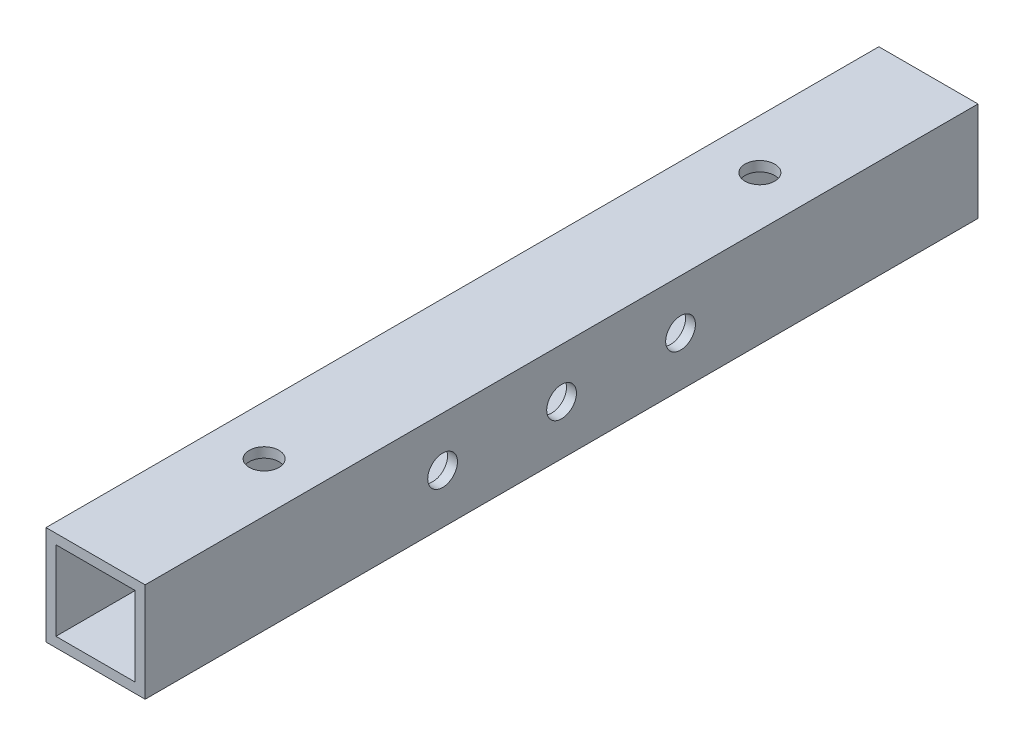
ISO-10303-21;
HEADER;
FILE_DESCRIPTION(('STEP AP214'),'2;1');
FILE_NAME('part.step','',(''),(''),'','','');
FILE_SCHEMA(('AUTOMOTIVE_DESIGN { 1 0 10303 214 1 1 1 1 }'));
ENDSEC;
DATA;
#1=APPLICATION_CONTEXT('core data for automotive mechanical design processes');
#2=APPLICATION_PROTOCOL_DEFINITION('international standard','automotive_design',2000,#1);
#3=PRODUCT_CONTEXT('',#1,'mechanical');
#4=PRODUCT('Part','Part','',(#3));
#5=PRODUCT_RELATED_PRODUCT_CATEGORY('part','',(#4));
#6=PRODUCT_DEFINITION_FORMATION('','',#4);
#7=PRODUCT_DEFINITION_CONTEXT('part definition',#1,'design');
#8=PRODUCT_DEFINITION('design','',#6,#7);
#9=PRODUCT_DEFINITION_SHAPE('','',#8);
#10=(LENGTH_UNIT() NAMED_UNIT(*) SI_UNIT(.MILLI.,.METRE.));
#11=(NAMED_UNIT(*) PLANE_ANGLE_UNIT() SI_UNIT($,.RADIAN.));
#12=(NAMED_UNIT(*) SI_UNIT($,.STERADIAN.) SOLID_ANGLE_UNIT());
#13=UNCERTAINTY_MEASURE_WITH_UNIT(LENGTH_MEASURE(1.E-05),#10,'distance_accuracy_value','');
#14=(GEOMETRIC_REPRESENTATION_CONTEXT(3) GLOBAL_UNCERTAINTY_ASSIGNED_CONTEXT((#13)) GLOBAL_UNIT_ASSIGNED_CONTEXT((#10,
#11,#12)) REPRESENTATION_CONTEXT('',''));
#15=CARTESIAN_POINT('',(0.,0.,0.));
#16=DIRECTION('',(0.,0.,1.));
#17=DIRECTION('',(1.,0.,0.));
#18=AXIS2_PLACEMENT_3D('',#15,#16,#17);
#19=CARTESIAN_POINT('',(0.,0.,84.));
#20=DIRECTION('',(0.,0.,1.));
#21=DIRECTION('',(1.,0.,0.));
#22=AXIS2_PLACEMENT_3D('',#19,#20,#21);
#23=PLANE('',#22);
#24=DIRECTION('',(0.,-1.,0.));
#25=VECTOR('',#24,1.);
#26=CARTESIAN_POINT('',(-5.,5.,84.));
#27=LINE('',#26,#25);
#28=CARTESIAN_POINT('',(-5.,5.,84.));
#29=VERTEX_POINT('',#28);
#30=CARTESIAN_POINT('',(-5.,-5.,84.));
#31=VERTEX_POINT('',#30);
#32=EDGE_CURVE('E168',#29,#31,#27,.T.);
#33=ORIENTED_EDGE('',*,*,#32,.T.);
#34=DIRECTION('',(1.,0.,0.));
#35=VECTOR('',#34,1.);
#36=CARTESIAN_POINT('',(-5.,-5.,84.));
#37=LINE('',#36,#35);
#38=CARTESIAN_POINT('',(5.,-5.,84.));
#39=VERTEX_POINT('',#38);
#40=EDGE_CURVE('E171',#31,#39,#37,.T.);
#41=ORIENTED_EDGE('',*,*,#40,.T.);
#42=DIRECTION('',(0.,1.,0.));
#43=VECTOR('',#42,1.);
#44=CARTESIAN_POINT('',(5.,5.,84.));
#45=LINE('',#44,#43);
#46=CARTESIAN_POINT('',(5.,5.,84.));
#47=VERTEX_POINT('',#46);
#48=EDGE_CURVE('E174',#39,#47,#45,.T.);
#49=ORIENTED_EDGE('',*,*,#48,.T.);
#50=DIRECTION('',(-1.,0.,0.));
#51=VECTOR('',#50,1.);
#52=CARTESIAN_POINT('',(-5.,5.,84.));
#53=LINE('',#52,#51);
#54=EDGE_CURVE('E176',#47,#29,#53,.T.);
#55=ORIENTED_EDGE('',*,*,#54,.T.);
#56=EDGE_LOOP('',(#33,#41,#49,#55));
#57=FACE_BOUND('',#56,.T.);
#58=DIRECTION('',(1.,0.,0.));
#59=VECTOR('',#58,1.);
#60=CARTESIAN_POINT('',(-5.,-4.,84.));
#61=LINE('',#60,#59);
#62=CARTESIAN_POINT('',(-4.,-4.,84.));
#63=VERTEX_POINT('',#62);
#64=CARTESIAN_POINT('',(4.,-4.,84.));
#65=VERTEX_POINT('',#64);
#66=EDGE_CURVE('E138',#63,#65,#61,.T.);
#67=ORIENTED_EDGE('',*,*,#66,.F.);
#68=DIRECTION('',(0.,-1.,0.));
#69=VECTOR('',#68,1.);
#70=CARTESIAN_POINT('',(-4.,5.,84.));
#71=LINE('',#70,#69);
#72=CARTESIAN_POINT('',(-4.,4.,84.));
#73=VERTEX_POINT('',#72);
#74=EDGE_CURVE('E130',#73,#63,#71,.T.);
#75=ORIENTED_EDGE('',*,*,#74,.F.);
#76=DIRECTION('',(-1.,0.,0.));
#77=VECTOR('',#76,1.);
#78=CARTESIAN_POINT('',(-5.,4.,84.));
#79=LINE('',#78,#77);
#80=CARTESIAN_POINT('',(4.,4.,84.));
#81=VERTEX_POINT('',#80);
#82=EDGE_CURVE('E152',#81,#73,#79,.T.);
#83=ORIENTED_EDGE('',*,*,#82,.F.);
#84=DIRECTION('',(0.,1.,0.));
#85=VECTOR('',#84,1.);
#86=CARTESIAN_POINT('',(4.,5.,84.));
#87=LINE('',#86,#85);
#88=EDGE_CURVE('E150',#65,#81,#87,.T.);
#89=ORIENTED_EDGE('',*,*,#88,.F.);
#90=EDGE_LOOP('',(#67,#75,#83,#89));
#91=FACE_BOUND('',#90,.T.);
#92=ADVANCED_FACE('F63',(#57,#91),#23,.T.);
#93=CARTESIAN_POINT('',(0.,0.,0.));
#94=DIRECTION('',(0.,0.,1.));
#95=DIRECTION('',(1.,0.,0.));
#96=AXIS2_PLACEMENT_3D('',#93,#94,#95);
#97=PLANE('',#96);
#98=DIRECTION('',(0.,-1.,0.));
#99=VECTOR('',#98,1.);
#100=CARTESIAN_POINT('',(-5.,5.,0.));
#101=LINE('',#100,#99);
#102=CARTESIAN_POINT('',(-5.,5.,0.));
#103=VERTEX_POINT('',#102);
#104=CARTESIAN_POINT('',(-5.,-5.,0.));
#105=VERTEX_POINT('',#104);
#106=EDGE_CURVE('E146',#103,#105,#101,.T.);
#107=ORIENTED_EDGE('',*,*,#106,.F.);
#108=DIRECTION('',(-1.,0.,0.));
#109=VECTOR('',#108,1.);
#110=CARTESIAN_POINT('',(-5.,5.,0.));
#111=LINE('',#110,#109);
#112=CARTESIAN_POINT('',(5.,5.,0.));
#113=VERTEX_POINT('',#112);
#114=EDGE_CURVE('E172',#113,#103,#111,.T.);
#115=ORIENTED_EDGE('',*,*,#114,.F.);
#116=DIRECTION('',(0.,1.,0.));
#117=VECTOR('',#116,1.);
#118=CARTESIAN_POINT('',(5.,5.,0.));
#119=LINE('',#118,#117);
#120=CARTESIAN_POINT('',(5.,-5.,0.));
#121=VERTEX_POINT('',#120);
#122=EDGE_CURVE('E183',#121,#113,#119,.T.);
#123=ORIENTED_EDGE('',*,*,#122,.F.);
#124=DIRECTION('',(1.,0.,0.));
#125=VECTOR('',#124,1.);
#126=CARTESIAN_POINT('',(-5.,-5.,0.));
#127=LINE('',#126,#125);
#128=EDGE_CURVE('E181',#105,#121,#127,.T.);
#129=ORIENTED_EDGE('',*,*,#128,.F.);
#130=EDGE_LOOP('',(#107,#115,#123,#129));
#131=FACE_BOUND('',#130,.T.);
#132=DIRECTION('',(0.,-1.,0.));
#133=VECTOR('',#132,1.);
#134=CARTESIAN_POINT('',(-4.,5.,0.));
#135=LINE('',#134,#133);
#136=CARTESIAN_POINT('',(-4.,4.,0.));
#137=VERTEX_POINT('',#136);
#138=CARTESIAN_POINT('',(-4.,-4.,0.));
#139=VERTEX_POINT('',#138);
#140=EDGE_CURVE('E88',#137,#139,#135,.T.);
#141=ORIENTED_EDGE('',*,*,#140,.T.);
#142=DIRECTION('',(1.,0.,0.));
#143=VECTOR('',#142,1.);
#144=CARTESIAN_POINT('',(-5.,-4.,0.));
#145=LINE('',#144,#143);
#146=CARTESIAN_POINT('',(4.,-4.,0.));
#147=VERTEX_POINT('',#146);
#148=EDGE_CURVE('E145',#139,#147,#145,.T.);
#149=ORIENTED_EDGE('',*,*,#148,.T.);
#150=DIRECTION('',(0.,1.,0.));
#151=VECTOR('',#150,1.);
#152=CARTESIAN_POINT('',(4.,5.,0.));
#153=LINE('',#152,#151);
#154=CARTESIAN_POINT('',(4.,4.,0.));
#155=VERTEX_POINT('',#154);
#156=EDGE_CURVE('E160',#147,#155,#153,.T.);
#157=ORIENTED_EDGE('',*,*,#156,.T.);
#158=DIRECTION('',(-1.,0.,0.));
#159=VECTOR('',#158,1.);
#160=CARTESIAN_POINT('',(-5.,4.,0.));
#161=LINE('',#160,#159);
#162=EDGE_CURVE('E139',#155,#137,#161,.T.);
#163=ORIENTED_EDGE('',*,*,#162,.T.);
#164=EDGE_LOOP('',(#141,#149,#157,#163));
#165=FACE_BOUND('',#164,.T.);
#166=ADVANCED_FACE('F275',(#131,#165),#97,.F.);
#167=CARTESIAN_POINT('',(-5.,5.,84.));
#168=DIRECTION('',(1.,0.,0.));
#169=DIRECTION('',(0.,0.,-1.));
#170=AXIS2_PLACEMENT_3D('',#167,#168,#169);
#171=PLANE('',#170);
#172=CARTESIAN_POINT('',(-5.,0.,54.));
#173=DIRECTION('',(1.,0.,0.));
#174=DIRECTION('',(0.,1.,0.));
#175=AXIS2_PLACEMENT_3D('',#172,#173,#174);
#176=CIRCLE('',#175,1.5);
#177=CARTESIAN_POINT('',(-5.,1.5,54.));
#178=VERTEX_POINT('',#177);
#179=EDGE_CURVE('E197',#178,#178,#176,.T.);
#180=ORIENTED_EDGE('',*,*,#179,.T.);
#181=EDGE_LOOP('',(#180));
#182=FACE_BOUND('',#181,.T.);
#183=CARTESIAN_POINT('',(-5.,0.,30.));
#184=DIRECTION('',(1.,0.,0.));
#185=DIRECTION('',(0.,1.,0.));
#186=AXIS2_PLACEMENT_3D('',#183,#184,#185);
#187=CIRCLE('',#186,1.5);
#188=CARTESIAN_POINT('',(-5.,1.50000000000001,30.));
#189=VERTEX_POINT('',#188);
#190=EDGE_CURVE('E238',#189,#189,#187,.T.);
#191=ORIENTED_EDGE('',*,*,#190,.T.);
#192=EDGE_LOOP('',(#191));
#193=FACE_BOUND('',#192,.T.);
#194=CARTESIAN_POINT('',(-5.,0.,42.));
#195=DIRECTION('',(1.,0.,0.));
#196=DIRECTION('',(0.,1.,0.));
#197=AXIS2_PLACEMENT_3D('',#194,#195,#196);
#198=CIRCLE('',#197,1.5);
#199=CARTESIAN_POINT('',(-5.,1.5,42.));
#200=VERTEX_POINT('',#199);
#201=EDGE_CURVE('E229',#200,#200,#198,.T.);
#202=ORIENTED_EDGE('',*,*,#201,.T.);
#203=EDGE_LOOP('',(#202));
#204=FACE_BOUND('',#203,.T.);
#205=ORIENTED_EDGE('',*,*,#106,.T.);
#206=DIRECTION('',(0.,0.,-1.));
#207=VECTOR('',#206,1.);
#208=CARTESIAN_POINT('',(-5.,-5.,84.));
#209=LINE('',#208,#207);
#210=EDGE_CURVE('E12',#31,#105,#209,.T.);
#211=ORIENTED_EDGE('',*,*,#210,.F.);
#212=ORIENTED_EDGE('',*,*,#32,.F.);
#213=DIRECTION('',(0.,0.,-1.));
#214=VECTOR('',#213,1.);
#215=CARTESIAN_POINT('',(-5.,5.,84.));
#216=LINE('',#215,#214);
#217=EDGE_CURVE('E178',#29,#103,#216,.T.);
#218=ORIENTED_EDGE('',*,*,#217,.T.);
#219=EDGE_LOOP('',(#205,#211,#212,#218));
#220=FACE_BOUND('',#219,.T.);
#221=ADVANCED_FACE('F65',(#182,#193,#204,#220),#171,.F.);
#222=CARTESIAN_POINT('',(-5.,-5.,84.));
#223=DIRECTION('',(0.,1.,0.));
#224=DIRECTION('',(0.,0.,1.));
#225=AXIS2_PLACEMENT_3D('',#222,#223,#224);
#226=PLANE('',#225);
#227=CARTESIAN_POINT('',(0.,-5.,17.));
#228=DIRECTION('',(0.,-1.,0.));
#229=DIRECTION('',(0.,0.,-1.));
#230=AXIS2_PLACEMENT_3D('',#227,#228,#229);
#231=CIRCLE('',#230,1.5);
#232=CARTESIAN_POINT('',(0.,-5.,15.5));
#233=VERTEX_POINT('',#232);
#234=EDGE_CURVE('E213',#233,#233,#231,.T.);
#235=ORIENTED_EDGE('',*,*,#234,.F.);
#236=EDGE_LOOP('',(#235));
#237=FACE_BOUND('',#236,.T.);
#238=CARTESIAN_POINT('',(0.,-5.,67.));
#239=DIRECTION('',(0.,-1.,0.));
#240=DIRECTION('',(0.,0.,1.));
#241=AXIS2_PLACEMENT_3D('',#238,#239,#240);
#242=CIRCLE('',#241,1.5);
#243=CARTESIAN_POINT('',(0.,-5.,68.5));
#244=VERTEX_POINT('',#243);
#245=EDGE_CURVE('E218',#244,#244,#242,.T.);
#246=ORIENTED_EDGE('',*,*,#245,.F.);
#247=EDGE_LOOP('',(#246));
#248=FACE_BOUND('',#247,.T.);
#249=ORIENTED_EDGE('',*,*,#128,.T.);
#250=DIRECTION('',(0.,0.,-1.));
#251=VECTOR('',#250,1.);
#252=CARTESIAN_POINT('',(5.,-5.,84.));
#253=LINE('',#252,#251);
#254=EDGE_CURVE('E72',#39,#121,#253,.T.);
#255=ORIENTED_EDGE('',*,*,#254,.F.);
#256=ORIENTED_EDGE('',*,*,#40,.F.);
#257=ORIENTED_EDGE('',*,*,#210,.T.);
#258=EDGE_LOOP('',(#249,#255,#256,#257));
#259=FACE_BOUND('',#258,.T.);
#260=ADVANCED_FACE('F274',(#237,#248,#259),#226,.F.);
#261=CARTESIAN_POINT('',(5.,5.,84.));
#262=DIRECTION('',(-1.,0.,0.));
#263=DIRECTION('',(0.,-1.,0.));
#264=AXIS2_PLACEMENT_3D('',#261,#262,#263);
#265=PLANE('',#264);
#266=CARTESIAN_POINT('',(5.,0.,54.));
#267=DIRECTION('',(1.,0.,0.));
#268=DIRECTION('',(0.,1.,0.));
#269=AXIS2_PLACEMENT_3D('',#266,#267,#268);
#270=CIRCLE('',#269,1.5);
#271=CARTESIAN_POINT('',(5.,1.5,54.));
#272=VERTEX_POINT('',#271);
#273=EDGE_CURVE('E232',#272,#272,#270,.T.);
#274=ORIENTED_EDGE('',*,*,#273,.F.);
#275=EDGE_LOOP('',(#274));
#276=FACE_BOUND('',#275,.T.);
#277=CARTESIAN_POINT('',(5.,0.,30.));
#278=DIRECTION('',(1.,0.,0.));
#279=DIRECTION('',(0.,1.,0.));
#280=AXIS2_PLACEMENT_3D('',#277,#278,#279);
#281=CIRCLE('',#280,1.5);
#282=CARTESIAN_POINT('',(5.,1.50000000000001,30.));
#283=VERTEX_POINT('',#282);
#284=EDGE_CURVE('E235',#283,#283,#281,.T.);
#285=ORIENTED_EDGE('',*,*,#284,.F.);
#286=EDGE_LOOP('',(#285));
#287=FACE_BOUND('',#286,.T.);
#288=CARTESIAN_POINT('',(5.,0.,42.));
#289=DIRECTION('',(1.,0.,0.));
#290=DIRECTION('',(0.,1.,0.));
#291=AXIS2_PLACEMENT_3D('',#288,#289,#290);
#292=CIRCLE('',#291,1.5);
#293=CARTESIAN_POINT('',(5.,1.5,42.));
#294=VERTEX_POINT('',#293);
#295=EDGE_CURVE('E241',#294,#294,#292,.T.);
#296=ORIENTED_EDGE('',*,*,#295,.F.);
#297=EDGE_LOOP('',(#296));
#298=FACE_BOUND('',#297,.T.);
#299=ORIENTED_EDGE('',*,*,#122,.T.);
#300=DIRECTION('',(0.,0.,-1.));
#301=VECTOR('',#300,1.);
#302=CARTESIAN_POINT('',(5.,5.,84.));
#303=LINE('',#302,#301);
#304=EDGE_CURVE('E188',#47,#113,#303,.T.);
#305=ORIENTED_EDGE('',*,*,#304,.F.);
#306=ORIENTED_EDGE('',*,*,#48,.F.);
#307=ORIENTED_EDGE('',*,*,#254,.T.);
#308=EDGE_LOOP('',(#299,#305,#306,#307));
#309=FACE_BOUND('',#308,.T.);
#310=ADVANCED_FACE('F293',(#276,#287,#298,#309),#265,.F.);
#311=CARTESIAN_POINT('',(-5.,5.,84.));
#312=DIRECTION('',(0.,-1.,0.));
#313=DIRECTION('',(0.,0.,-1.));
#314=AXIS2_PLACEMENT_3D('',#311,#312,#313);
#315=PLANE('',#314);
#316=CARTESIAN_POINT('',(0.,5.,17.));
#317=DIRECTION('',(0.,-1.,0.));
#318=DIRECTION('',(0.,0.,-1.));
#319=AXIS2_PLACEMENT_3D('',#316,#317,#318);
#320=CIRCLE('',#319,1.5);
#321=CARTESIAN_POINT('',(0.,5.,15.5));
#322=VERTEX_POINT('',#321);
#323=EDGE_CURVE('E207',#322,#322,#320,.T.);
#324=ORIENTED_EDGE('',*,*,#323,.T.);
#325=EDGE_LOOP('',(#324));
#326=FACE_BOUND('',#325,.T.);
#327=CARTESIAN_POINT('',(0.,5.,67.));
#328=DIRECTION('',(0.,-1.,0.));
#329=DIRECTION('',(0.,0.,1.));
#330=AXIS2_PLACEMENT_3D('',#327,#328,#329);
#331=CIRCLE('',#330,1.5);
#332=CARTESIAN_POINT('',(0.,5.,68.5));
#333=VERTEX_POINT('',#332);
#334=EDGE_CURVE('E223',#333,#333,#331,.T.);
#335=ORIENTED_EDGE('',*,*,#334,.T.);
#336=EDGE_LOOP('',(#335));
#337=FACE_BOUND('',#336,.T.);
#338=ORIENTED_EDGE('',*,*,#114,.T.);
#339=ORIENTED_EDGE('',*,*,#217,.F.);
#340=ORIENTED_EDGE('',*,*,#54,.F.);
#341=ORIENTED_EDGE('',*,*,#304,.T.);
#342=EDGE_LOOP('',(#338,#339,#340,#341));
#343=FACE_BOUND('',#342,.T.);
#344=ADVANCED_FACE('F257',(#326,#337,#343),#315,.F.);
#345=CARTESIAN_POINT('',(-4.,5.,84.));
#346=DIRECTION('',(1.,0.,0.));
#347=DIRECTION('',(0.,0.,-1.));
#348=AXIS2_PLACEMENT_3D('',#345,#346,#347);
#349=PLANE('',#348);
#350=CARTESIAN_POINT('',(-4.,0.,54.));
#351=DIRECTION('',(1.,0.,0.));
#352=DIRECTION('',(0.,0.,-1.));
#353=AXIS2_PLACEMENT_3D('',#350,#351,#352);
#354=CIRCLE('',#353,1.5);
#355=CARTESIAN_POINT('',(-4.,0.,52.5));
#356=VERTEX_POINT('',#355);
#357=EDGE_CURVE('E158',#356,#356,#354,.T.);
#358=ORIENTED_EDGE('',*,*,#357,.F.);
#359=EDGE_LOOP('',(#358));
#360=FACE_BOUND('',#359,.T.);
#361=CARTESIAN_POINT('',(-4.,0.,30.));
#362=DIRECTION('',(1.,0.,0.));
#363=DIRECTION('',(0.,0.,-1.));
#364=AXIS2_PLACEMENT_3D('',#361,#362,#363);
#365=CIRCLE('',#364,1.5);
#366=CARTESIAN_POINT('',(-4.,0.,28.5));
#367=VERTEX_POINT('',#366);
#368=EDGE_CURVE('E201',#367,#367,#365,.T.);
#369=ORIENTED_EDGE('',*,*,#368,.F.);
#370=EDGE_LOOP('',(#369));
#371=FACE_BOUND('',#370,.T.);
#372=CARTESIAN_POINT('',(-4.,0.,42.));
#373=DIRECTION('',(1.,0.,0.));
#374=DIRECTION('',(0.,0.,-1.));
#375=AXIS2_PLACEMENT_3D('',#372,#373,#374);
#376=CIRCLE('',#375,1.5);
#377=CARTESIAN_POINT('',(-4.,0.,40.5));
#378=VERTEX_POINT('',#377);
#379=EDGE_CURVE('E196',#378,#378,#376,.T.);
#380=ORIENTED_EDGE('',*,*,#379,.F.);
#381=EDGE_LOOP('',(#380));
#382=FACE_BOUND('',#381,.T.);
#383=ORIENTED_EDGE('',*,*,#140,.F.);
#384=DIRECTION('',(0.,0.,-1.));
#385=VECTOR('',#384,1.);
#386=CARTESIAN_POINT('',(-4.,4.,84.));
#387=LINE('',#386,#385);
#388=EDGE_CURVE('E134',#73,#137,#387,.T.);
#389=ORIENTED_EDGE('',*,*,#388,.F.);
#390=ORIENTED_EDGE('',*,*,#74,.T.);
#391=DIRECTION('',(0.,0.,-1.));
#392=VECTOR('',#391,1.);
#393=CARTESIAN_POINT('',(-4.,-4.,84.));
#394=LINE('',#393,#392);
#395=EDGE_CURVE('E133',#63,#139,#394,.T.);
#396=ORIENTED_EDGE('',*,*,#395,.T.);
#397=EDGE_LOOP('',(#383,#389,#390,#396));
#398=FACE_BOUND('',#397,.T.);
#399=ADVANCED_FACE('F132',(#360,#371,#382,#398),#349,.T.);
#400=CARTESIAN_POINT('',(-5.,-4.,84.));
#401=DIRECTION('',(0.,1.,0.));
#402=DIRECTION('',(0.,0.,1.));
#403=AXIS2_PLACEMENT_3D('',#400,#401,#402);
#404=PLANE('',#403);
#405=CARTESIAN_POINT('',(0.,-4.,17.));
#406=DIRECTION('',(0.,1.,0.));
#407=DIRECTION('',(0.,0.,1.));
#408=AXIS2_PLACEMENT_3D('',#405,#406,#407);
#409=CIRCLE('',#408,1.5);
#410=CARTESIAN_POINT('',(0.,-4.,18.5));
#411=VERTEX_POINT('',#410);
#412=EDGE_CURVE('E226',#411,#411,#409,.T.);
#413=ORIENTED_EDGE('',*,*,#412,.F.);
#414=EDGE_LOOP('',(#413));
#415=FACE_BOUND('',#414,.T.);
#416=CARTESIAN_POINT('',(0.,-4.,67.));
#417=DIRECTION('',(0.,1.,0.));
#418=DIRECTION('',(0.,0.,1.));
#419=AXIS2_PLACEMENT_3D('',#416,#417,#418);
#420=CIRCLE('',#419,1.5);
#421=CARTESIAN_POINT('',(0.,-4.,68.5));
#422=VERTEX_POINT('',#421);
#423=EDGE_CURVE('E206',#422,#422,#420,.T.);
#424=ORIENTED_EDGE('',*,*,#423,.F.);
#425=EDGE_LOOP('',(#424));
#426=FACE_BOUND('',#425,.T.);
#427=ORIENTED_EDGE('',*,*,#148,.F.);
#428=ORIENTED_EDGE('',*,*,#395,.F.);
#429=ORIENTED_EDGE('',*,*,#66,.T.);
#430=DIRECTION('',(0.,0.,-1.));
#431=VECTOR('',#430,1.);
#432=CARTESIAN_POINT('',(4.,-4.,84.));
#433=LINE('',#432,#431);
#434=EDGE_CURVE('E147',#65,#147,#433,.T.);
#435=ORIENTED_EDGE('',*,*,#434,.T.);
#436=EDGE_LOOP('',(#427,#428,#429,#435));
#437=FACE_BOUND('',#436,.T.);
#438=ADVANCED_FACE('F142',(#415,#426,#437),#404,.T.);
#439=CARTESIAN_POINT('',(4.,5.,84.));
#440=DIRECTION('',(-1.,0.,0.));
#441=DIRECTION('',(0.,-1.,0.));
#442=AXIS2_PLACEMENT_3D('',#439,#440,#441);
#443=PLANE('',#442);
#444=CARTESIAN_POINT('',(4.,0.,54.));
#445=DIRECTION('',(-1.,0.,0.));
#446=DIRECTION('',(0.,-1.,0.));
#447=AXIS2_PLACEMENT_3D('',#444,#445,#446);
#448=CIRCLE('',#447,1.5);
#449=CARTESIAN_POINT('',(4.,-1.5,54.));
#450=VERTEX_POINT('',#449);
#451=EDGE_CURVE('E202',#450,#450,#448,.T.);
#452=ORIENTED_EDGE('',*,*,#451,.F.);
#453=EDGE_LOOP('',(#452));
#454=FACE_BOUND('',#453,.T.);
#455=CARTESIAN_POINT('',(4.,0.,30.));
#456=DIRECTION('',(-1.,0.,0.));
#457=DIRECTION('',(0.,-1.,0.));
#458=AXIS2_PLACEMENT_3D('',#455,#456,#457);
#459=CIRCLE('',#458,1.5);
#460=CARTESIAN_POINT('',(4.,-1.5,30.));
#461=VERTEX_POINT('',#460);
#462=EDGE_CURVE('E198',#461,#461,#459,.T.);
#463=ORIENTED_EDGE('',*,*,#462,.F.);
#464=EDGE_LOOP('',(#463));
#465=FACE_BOUND('',#464,.T.);
#466=CARTESIAN_POINT('',(4.,0.,42.));
#467=DIRECTION('',(-1.,0.,0.));
#468=DIRECTION('',(0.,-1.,0.));
#469=AXIS2_PLACEMENT_3D('',#466,#467,#468);
#470=CIRCLE('',#469,1.5);
#471=CARTESIAN_POINT('',(4.,-1.5,42.));
#472=VERTEX_POINT('',#471);
#473=EDGE_CURVE('E193',#472,#472,#470,.T.);
#474=ORIENTED_EDGE('',*,*,#473,.F.);
#475=EDGE_LOOP('',(#474));
#476=FACE_BOUND('',#475,.T.);
#477=ORIENTED_EDGE('',*,*,#156,.F.);
#478=ORIENTED_EDGE('',*,*,#434,.F.);
#479=ORIENTED_EDGE('',*,*,#88,.T.);
#480=DIRECTION('',(0.,0.,-1.));
#481=VECTOR('',#480,1.);
#482=CARTESIAN_POINT('',(4.,4.,84.));
#483=LINE('',#482,#481);
#484=EDGE_CURVE('E80',#81,#155,#483,.T.);
#485=ORIENTED_EDGE('',*,*,#484,.T.);
#486=EDGE_LOOP('',(#477,#478,#479,#485));
#487=FACE_BOUND('',#486,.T.);
#488=ADVANCED_FACE('F314',(#454,#465,#476,#487),#443,.T.);
#489=CARTESIAN_POINT('',(-5.,4.,84.));
#490=DIRECTION('',(0.,-1.,0.));
#491=DIRECTION('',(0.,0.,-1.));
#492=AXIS2_PLACEMENT_3D('',#489,#490,#491);
#493=PLANE('',#492);
#494=CARTESIAN_POINT('',(0.,4.,17.));
#495=DIRECTION('',(0.,-1.,0.));
#496=DIRECTION('',(0.,0.,-1.));
#497=AXIS2_PLACEMENT_3D('',#494,#495,#496);
#498=CIRCLE('',#497,1.5);
#499=CARTESIAN_POINT('',(0.,4.,15.5));
#500=VERTEX_POINT('',#499);
#501=EDGE_CURVE('E67',#500,#500,#498,.T.);
#502=ORIENTED_EDGE('',*,*,#501,.F.);
#503=EDGE_LOOP('',(#502));
#504=FACE_BOUND('',#503,.T.);
#505=CARTESIAN_POINT('',(0.,4.,67.));
#506=DIRECTION('',(0.,-1.,0.));
#507=DIRECTION('',(0.,0.,-1.));
#508=AXIS2_PLACEMENT_3D('',#505,#506,#507);
#509=CIRCLE('',#508,1.5);
#510=CARTESIAN_POINT('',(0.,4.,65.5));
#511=VERTEX_POINT('',#510);
#512=EDGE_CURVE('E204',#511,#511,#509,.T.);
#513=ORIENTED_EDGE('',*,*,#512,.F.);
#514=EDGE_LOOP('',(#513));
#515=FACE_BOUND('',#514,.T.);
#516=ORIENTED_EDGE('',*,*,#162,.F.);
#517=ORIENTED_EDGE('',*,*,#484,.F.);
#518=ORIENTED_EDGE('',*,*,#82,.T.);
#519=ORIENTED_EDGE('',*,*,#388,.T.);
#520=EDGE_LOOP('',(#516,#517,#518,#519));
#521=FACE_BOUND('',#520,.T.);
#522=ADVANCED_FACE('F318',(#504,#515,#521),#493,.T.);
#523=CARTESIAN_POINT('',(-5.,0.,42.));
#524=DIRECTION('',(1.,0.,0.));
#525=DIRECTION('',(0.,1.,0.));
#526=AXIS2_PLACEMENT_3D('',#523,#524,#525);
#527=CYLINDRICAL_SURFACE('',#526,1.5);
#528=ORIENTED_EDGE('',*,*,#473,.T.);
#529=EDGE_LOOP('',(#528));
#530=FACE_BOUND('',#529,.T.);
#531=ORIENTED_EDGE('',*,*,#295,.T.);
#532=EDGE_LOOP('',(#531));
#533=FACE_BOUND('',#532,.T.);
#534=ADVANCED_FACE('F269',(#530,#533),#527,.F.);
#535=CARTESIAN_POINT('',(-5.,0.,30.));
#536=DIRECTION('',(1.,0.,0.));
#537=DIRECTION('',(0.,1.,0.));
#538=AXIS2_PLACEMENT_3D('',#535,#536,#537);
#539=CYLINDRICAL_SURFACE('',#538,1.5);
#540=ORIENTED_EDGE('',*,*,#462,.T.);
#541=EDGE_LOOP('',(#540));
#542=FACE_BOUND('',#541,.T.);
#543=ORIENTED_EDGE('',*,*,#284,.T.);
#544=EDGE_LOOP('',(#543));
#545=FACE_BOUND('',#544,.T.);
#546=ADVANCED_FACE('F324',(#542,#545),#539,.F.);
#547=CARTESIAN_POINT('',(-5.,0.,54.));
#548=DIRECTION('',(1.,0.,0.));
#549=DIRECTION('',(0.,1.,0.));
#550=AXIS2_PLACEMENT_3D('',#547,#548,#549);
#551=CYLINDRICAL_SURFACE('',#550,1.5);
#552=ORIENTED_EDGE('',*,*,#451,.T.);
#553=EDGE_LOOP('',(#552));
#554=FACE_BOUND('',#553,.T.);
#555=ORIENTED_EDGE('',*,*,#273,.T.);
#556=EDGE_LOOP('',(#555));
#557=FACE_BOUND('',#556,.T.);
#558=ADVANCED_FACE('F267',(#554,#557),#551,.F.);
#559=ORIENTED_EDGE('',*,*,#379,.T.);
#560=EDGE_LOOP('',(#559));
#561=FACE_BOUND('',#560,.T.);
#562=ORIENTED_EDGE('',*,*,#201,.F.);
#563=EDGE_LOOP('',(#562));
#564=FACE_BOUND('',#563,.T.);
#565=ADVANCED_FACE('F263',(#561,#564),#527,.F.);
#566=ORIENTED_EDGE('',*,*,#368,.T.);
#567=EDGE_LOOP('',(#566));
#568=FACE_BOUND('',#567,.T.);
#569=ORIENTED_EDGE('',*,*,#190,.F.);
#570=EDGE_LOOP('',(#569));
#571=FACE_BOUND('',#570,.T.);
#572=ADVANCED_FACE('F266',(#568,#571),#539,.F.);
#573=ORIENTED_EDGE('',*,*,#357,.T.);
#574=EDGE_LOOP('',(#573));
#575=FACE_BOUND('',#574,.T.);
#576=ORIENTED_EDGE('',*,*,#179,.F.);
#577=EDGE_LOOP('',(#576));
#578=FACE_BOUND('',#577,.T.);
#579=ADVANCED_FACE('F252',(#575,#578),#551,.F.);
#580=CARTESIAN_POINT('',(0.,5.,67.));
#581=DIRECTION('',(0.,-1.,0.));
#582=DIRECTION('',(0.,0.,-1.));
#583=AXIS2_PLACEMENT_3D('',#580,#581,#582);
#584=CYLINDRICAL_SURFACE('',#583,1.5);
#585=ORIENTED_EDGE('',*,*,#512,.T.);
#586=EDGE_LOOP('',(#585));
#587=FACE_BOUND('',#586,.T.);
#588=ORIENTED_EDGE('',*,*,#334,.F.);
#589=EDGE_LOOP('',(#588));
#590=FACE_BOUND('',#589,.T.);
#591=ADVANCED_FACE('F332',(#587,#590),#584,.F.);
#592=CARTESIAN_POINT('',(0.,5.,17.));
#593=DIRECTION('',(0.,-1.,0.));
#594=DIRECTION('',(0.,0.,-1.));
#595=AXIS2_PLACEMENT_3D('',#592,#593,#594);
#596=CYLINDRICAL_SURFACE('',#595,1.5);
#597=ORIENTED_EDGE('',*,*,#501,.T.);
#598=EDGE_LOOP('',(#597));
#599=FACE_BOUND('',#598,.T.);
#600=ORIENTED_EDGE('',*,*,#323,.F.);
#601=EDGE_LOOP('',(#600));
#602=FACE_BOUND('',#601,.T.);
#603=ADVANCED_FACE('F335',(#599,#602),#596,.F.);
#604=ORIENTED_EDGE('',*,*,#423,.T.);
#605=EDGE_LOOP('',(#604));
#606=FACE_BOUND('',#605,.T.);
#607=ORIENTED_EDGE('',*,*,#245,.T.);
#608=EDGE_LOOP('',(#607));
#609=FACE_BOUND('',#608,.T.);
#610=ADVANCED_FACE('F336',(#606,#609),#584,.F.);
#611=ORIENTED_EDGE('',*,*,#412,.T.);
#612=EDGE_LOOP('',(#611));
#613=FACE_BOUND('',#612,.T.);
#614=ORIENTED_EDGE('',*,*,#234,.T.);
#615=EDGE_LOOP('',(#614));
#616=FACE_BOUND('',#615,.T.);
#617=ADVANCED_FACE('F339',(#613,#616),#596,.F.);
#618=CLOSED_SHELL('',(#92,#166,#221,#260,#310,#344,#399,#438,#488,#522,#534,#546,#558,#565,#572,
#579,#591,#603,#610,#617));
#619=MANIFOLD_SOLID_BREP('B2',#618);
#620=ADVANCED_BREP_SHAPE_REPRESENTATION('',(#18,#619),#14);
#621=SHAPE_DEFINITION_REPRESENTATION(#9,#620);
ENDSEC;
END-ISO-10303-21;
